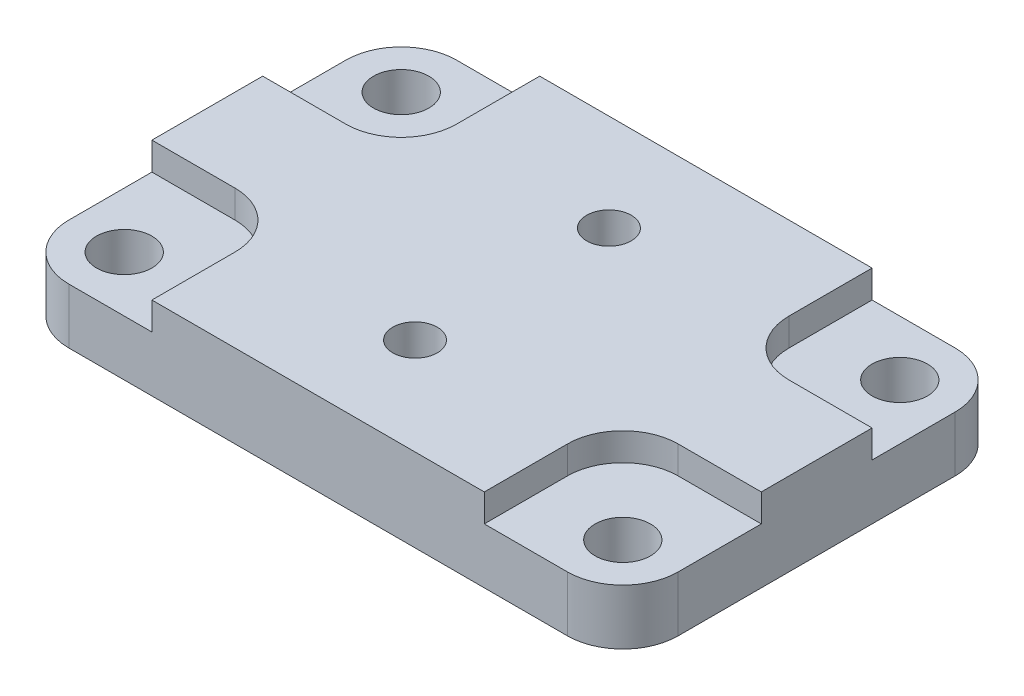
ISO-10303-21;
HEADER;
FILE_DESCRIPTION(('STEP AP214'),'2;1');
FILE_NAME('part.step','',(''),(''),'','','');
FILE_SCHEMA(('AUTOMOTIVE_DESIGN { 1 0 10303 214 1 1 1 1 }'));
ENDSEC;
DATA;
#1=APPLICATION_CONTEXT('core data for automotive mechanical design processes');
#2=APPLICATION_PROTOCOL_DEFINITION('international standard','automotive_design',2000,#1);
#3=PRODUCT_CONTEXT('',#1,'mechanical');
#4=PRODUCT('Part','Part','',(#3));
#5=PRODUCT_RELATED_PRODUCT_CATEGORY('part','',(#4));
#6=PRODUCT_DEFINITION_FORMATION('','',#4);
#7=PRODUCT_DEFINITION_CONTEXT('part definition',#1,'design');
#8=PRODUCT_DEFINITION('design','',#6,#7);
#9=PRODUCT_DEFINITION_SHAPE('','',#8);
#10=(LENGTH_UNIT() NAMED_UNIT(*) SI_UNIT(.MILLI.,.METRE.));
#11=(NAMED_UNIT(*) PLANE_ANGLE_UNIT() SI_UNIT($,.RADIAN.));
#12=(NAMED_UNIT(*) SI_UNIT($,.STERADIAN.) SOLID_ANGLE_UNIT());
#13=UNCERTAINTY_MEASURE_WITH_UNIT(LENGTH_MEASURE(1.E-05),#10,'distance_accuracy_value','');
#14=(GEOMETRIC_REPRESENTATION_CONTEXT(3) GLOBAL_UNCERTAINTY_ASSIGNED_CONTEXT((#13)) GLOBAL_UNIT_ASSIGNED_CONTEXT((#10,
#11,#12)) REPRESENTATION_CONTEXT('',''));
#15=CARTESIAN_POINT('',(0.,0.,0.));
#16=DIRECTION('',(0.,0.,1.));
#17=DIRECTION('',(1.,0.,0.));
#18=AXIS2_PLACEMENT_3D('',#15,#16,#17);
#19=CARTESIAN_POINT('',(0.,9.525,0.));
#20=DIRECTION('',(0.,1.,0.));
#21=DIRECTION('',(0.,0.,1.));
#22=AXIS2_PLACEMENT_3D('',#19,#20,#21);
#23=PLANE('',#22);
#24=DIRECTION('',(0.,0.,1.));
#25=VECTOR('',#24,1.);
#26=CARTESIAN_POINT('',(19.05,9.525,22.225));
#27=LINE('',#26,#25);
#28=CARTESIAN_POINT('',(19.05,9.525,12.7));
#29=VERTEX_POINT('',#28);
#30=CARTESIAN_POINT('',(19.05,9.525,22.225));
#31=VERTEX_POINT('',#30);
#32=EDGE_CURVE('E217',#29,#31,#27,.T.);
#33=ORIENTED_EDGE('',*,*,#32,.F.);
#34=CARTESIAN_POINT('',(25.4,9.525,12.7));
#35=DIRECTION('',(0.,1.,0.));
#36=DIRECTION('',(0.,0.,1.));
#37=AXIS2_PLACEMENT_3D('',#34,#35,#36);
#38=CIRCLE('',#37,6.35);
#39=CARTESIAN_POINT('',(25.4,9.525,6.35));
#40=VERTEX_POINT('',#39);
#41=EDGE_CURVE('E11',#29,#40,#38,.F.);
#42=ORIENTED_EDGE('',*,*,#41,.T.);
#43=DIRECTION('',(-1.,0.,0.));
#44=VECTOR('',#43,1.);
#45=CARTESIAN_POINT('',(19.05,9.525,6.35));
#46=LINE('',#45,#44);
#47=CARTESIAN_POINT('',(34.925,9.525,6.35));
#48=VERTEX_POINT('',#47);
#49=EDGE_CURVE('E212',#48,#40,#46,.T.);
#50=ORIENTED_EDGE('',*,*,#49,.F.);
#51=DIRECTION('',(0.,0.,-1.));
#52=VECTOR('',#51,1.);
#53=CARTESIAN_POINT('',(34.925,9.525,-22.225));
#54=LINE('',#53,#52);
#55=CARTESIAN_POINT('',(34.925,9.525,-6.35));
#56=VERTEX_POINT('',#55);
#57=EDGE_CURVE('E389',#48,#56,#54,.T.);
#58=ORIENTED_EDGE('',*,*,#57,.T.);
#59=DIRECTION('',(-1.,0.,0.));
#60=VECTOR('',#59,1.);
#61=CARTESIAN_POINT('',(19.05,9.525,-6.35));
#62=LINE('',#61,#60);
#63=CARTESIAN_POINT('',(25.4,9.525,-6.35));
#64=VERTEX_POINT('',#63);
#65=EDGE_CURVE('E253',#56,#64,#62,.T.);
#66=ORIENTED_EDGE('',*,*,#65,.T.);
#67=CARTESIAN_POINT('',(25.4,9.525,-12.7));
#68=DIRECTION('',(0.,1.,0.));
#69=DIRECTION('',(0.,0.,1.));
#70=AXIS2_PLACEMENT_3D('',#67,#68,#69);
#71=CIRCLE('',#70,6.35);
#72=CARTESIAN_POINT('',(19.05,9.525,-12.7));
#73=VERTEX_POINT('',#72);
#74=EDGE_CURVE('E499',#64,#73,#71,.F.);
#75=ORIENTED_EDGE('',*,*,#74,.T.);
#76=DIRECTION('',(0.,0.,-1.));
#77=VECTOR('',#76,1.);
#78=CARTESIAN_POINT('',(19.05,9.525,-22.225));
#79=LINE('',#78,#77);
#80=CARTESIAN_POINT('',(19.05,9.525,-22.225));
#81=VERTEX_POINT('',#80);
#82=EDGE_CURVE('E248',#73,#81,#79,.T.);
#83=ORIENTED_EDGE('',*,*,#82,.T.);
#84=DIRECTION('',(-1.,0.,0.));
#85=VECTOR('',#84,1.);
#86=CARTESIAN_POINT('',(-34.925,9.525,-22.225));
#87=LINE('',#86,#85);
#88=CARTESIAN_POINT('',(-19.05,9.525,-22.225));
#89=VERTEX_POINT('',#88);
#90=EDGE_CURVE('E392',#81,#89,#87,.T.);
#91=ORIENTED_EDGE('',*,*,#90,.T.);
#92=DIRECTION('',(0.,0.,-1.));
#93=VECTOR('',#92,1.);
#94=CARTESIAN_POINT('',(-19.05,9.525,-22.225));
#95=LINE('',#94,#93);
#96=CARTESIAN_POINT('',(-19.05,9.525,-12.7));
#97=VERTEX_POINT('',#96);
#98=EDGE_CURVE('E316',#97,#89,#95,.T.);
#99=ORIENTED_EDGE('',*,*,#98,.F.);
#100=CARTESIAN_POINT('',(-25.4,9.525,-12.7));
#101=DIRECTION('',(0.,1.,0.));
#102=DIRECTION('',(0.,0.,1.));
#103=AXIS2_PLACEMENT_3D('',#100,#101,#102);
#104=CIRCLE('',#103,6.35);
#105=CARTESIAN_POINT('',(-25.4,9.525,-6.35));
#106=VERTEX_POINT('',#105);
#107=EDGE_CURVE('E467',#97,#106,#104,.F.);
#108=ORIENTED_EDGE('',*,*,#107,.T.);
#109=DIRECTION('',(1.,0.,0.));
#110=VECTOR('',#109,1.);
#111=CARTESIAN_POINT('',(-19.05,9.525,-6.35));
#112=LINE('',#111,#110);
#113=CARTESIAN_POINT('',(-34.925,9.525,-6.35));
#114=VERTEX_POINT('',#113);
#115=EDGE_CURVE('E321',#114,#106,#112,.T.);
#116=ORIENTED_EDGE('',*,*,#115,.F.);
#117=DIRECTION('',(0.,0.,1.));
#118=VECTOR('',#117,1.);
#119=CARTESIAN_POINT('',(-34.925,9.525,-22.225));
#120=LINE('',#119,#118);
#121=CARTESIAN_POINT('',(-34.925,9.525,6.35));
#122=VERTEX_POINT('',#121);
#123=EDGE_CURVE('E396',#114,#122,#120,.T.);
#124=ORIENTED_EDGE('',*,*,#123,.T.);
#125=DIRECTION('',(1.,0.,0.));
#126=VECTOR('',#125,1.);
#127=CARTESIAN_POINT('',(-19.05,9.525,6.35));
#128=LINE('',#127,#126);
#129=CARTESIAN_POINT('',(-25.4,9.525,6.35));
#130=VERTEX_POINT('',#129);
#131=EDGE_CURVE('E287',#122,#130,#128,.T.);
#132=ORIENTED_EDGE('',*,*,#131,.T.);
#133=CARTESIAN_POINT('',(-25.4,9.525,12.7));
#134=DIRECTION('',(0.,1.,0.));
#135=DIRECTION('',(0.,0.,1.));
#136=AXIS2_PLACEMENT_3D('',#133,#134,#135);
#137=CIRCLE('',#136,6.35);
#138=CARTESIAN_POINT('',(-19.05,9.525,12.7));
#139=VERTEX_POINT('',#138);
#140=EDGE_CURVE('E483',#130,#139,#137,.F.);
#141=ORIENTED_EDGE('',*,*,#140,.T.);
#142=DIRECTION('',(0.,0.,1.));
#143=VECTOR('',#142,1.);
#144=CARTESIAN_POINT('',(-19.05,9.525,22.225));
#145=LINE('',#144,#143);
#146=CARTESIAN_POINT('',(-19.05,9.525,22.225));
#147=VERTEX_POINT('',#146);
#148=EDGE_CURVE('E282',#139,#147,#145,.T.);
#149=ORIENTED_EDGE('',*,*,#148,.T.);
#150=DIRECTION('',(1.,0.,0.));
#151=VECTOR('',#150,1.);
#152=CARTESIAN_POINT('',(-34.925,9.525,22.225));
#153=LINE('',#152,#151);
#154=EDGE_CURVE('E400',#147,#31,#153,.T.);
#155=ORIENTED_EDGE('',*,*,#154,.T.);
#156=EDGE_LOOP('',(#33,#42,#50,#58,#66,#75,#83,#91,#99,#108,#116,#124,#132,#141,#149,#155));
#157=FACE_BOUND('',#156,.T.);
#158=CARTESIAN_POINT('',(0.,9.525,11.1125));
#159=DIRECTION('',(0.,-1.,0.));
#160=DIRECTION('',(0.,0.,-1.));
#161=AXIS2_PLACEMENT_3D('',#158,#159,#160);
#162=CIRCLE('',#161,2.5527);
#163=CARTESIAN_POINT('',(0.,9.525,8.5598));
#164=VERTEX_POINT('',#163);
#165=EDGE_CURVE('E384',#164,#164,#162,.T.);
#166=ORIENTED_EDGE('',*,*,#165,.T.);
#167=EDGE_LOOP('',(#166));
#168=FACE_BOUND('',#167,.T.);
#169=CARTESIAN_POINT('',(0.,9.525,-11.1125));
#170=DIRECTION('',(0.,-1.,0.));
#171=DIRECTION('',(0.,0.,-1.));
#172=AXIS2_PLACEMENT_3D('',#169,#170,#171);
#173=CIRCLE('',#172,2.5527);
#174=CARTESIAN_POINT('',(0.,9.525,-13.6652));
#175=VERTEX_POINT('',#174);
#176=EDGE_CURVE('E372',#175,#175,#173,.T.);
#177=ORIENTED_EDGE('',*,*,#176,.T.);
#178=EDGE_LOOP('',(#177));
#179=FACE_BOUND('',#178,.T.);
#180=ADVANCED_FACE('F39',(#157,#168,#179),#23,.T.);
#181=CARTESIAN_POINT('',(34.925,9.525,-22.225));
#182=DIRECTION('',(-1.,0.,0.));
#183=DIRECTION('',(0.,0.,1.));
#184=AXIS2_PLACEMENT_3D('',#181,#182,#183);
#185=PLANE('',#184);
#186=ORIENTED_EDGE('',*,*,#57,.F.);
#187=DIRECTION('',(0.,1.,0.));
#188=VECTOR('',#187,1.);
#189=CARTESIAN_POINT('',(34.925,6.35,6.35));
#190=LINE('',#189,#188);
#191=CARTESIAN_POINT('',(34.925,6.35,6.35));
#192=VERTEX_POINT('',#191);
#193=EDGE_CURVE('E222',#192,#48,#190,.T.);
#194=ORIENTED_EDGE('',*,*,#193,.F.);
#195=DIRECTION('',(0.,0.,-1.));
#196=VECTOR('',#195,1.);
#197=CARTESIAN_POINT('',(34.925,6.35,22.225));
#198=LINE('',#197,#196);
#199=CARTESIAN_POINT('',(34.925,6.35,15.875));
#200=VERTEX_POINT('',#199);
#201=EDGE_CURVE('E231',#200,#192,#198,.T.);
#202=ORIENTED_EDGE('',*,*,#201,.F.);
#203=DIRECTION('',(0.,-1.,0.));
#204=VECTOR('',#203,1.);
#205=CARTESIAN_POINT('',(34.925,9.525,15.875));
#206=LINE('',#205,#204);
#207=CARTESIAN_POINT('',(34.925,0.,15.875));
#208=VERTEX_POINT('',#207);
#209=EDGE_CURVE('E444',#200,#208,#206,.T.);
#210=ORIENTED_EDGE('',*,*,#209,.T.);
#211=DIRECTION('',(0.,0.,-1.));
#212=VECTOR('',#211,1.);
#213=CARTESIAN_POINT('',(34.925,0.,-22.225));
#214=LINE('',#213,#212);
#215=CARTESIAN_POINT('',(34.925,0.,-15.875));
#216=VERTEX_POINT('',#215);
#217=EDGE_CURVE('E388',#208,#216,#214,.T.);
#218=ORIENTED_EDGE('',*,*,#217,.T.);
#219=DIRECTION('',(0.,-1.,0.));
#220=VECTOR('',#219,1.);
#221=CARTESIAN_POINT('',(34.925,9.525,-15.875));
#222=LINE('',#221,#220);
#223=CARTESIAN_POINT('',(34.925,6.35,-15.875));
#224=VERTEX_POINT('',#223);
#225=EDGE_CURVE('E440',#216,#224,#222,.F.);
#226=ORIENTED_EDGE('',*,*,#225,.T.);
#227=DIRECTION('',(0.,0.,1.));
#228=VECTOR('',#227,1.);
#229=CARTESIAN_POINT('',(34.925,6.35,-22.225));
#230=LINE('',#229,#228);
#231=CARTESIAN_POINT('',(34.925,6.35,-6.35));
#232=VERTEX_POINT('',#231);
#233=EDGE_CURVE('E257',#224,#232,#230,.T.);
#234=ORIENTED_EDGE('',*,*,#233,.T.);
#235=DIRECTION('',(0.,1.,0.));
#236=VECTOR('',#235,1.);
#237=CARTESIAN_POINT('',(34.925,6.35,-6.35));
#238=LINE('',#237,#236);
#239=EDGE_CURVE('E265',#232,#56,#238,.T.);
#240=ORIENTED_EDGE('',*,*,#239,.T.);
#241=EDGE_LOOP('',(#186,#194,#202,#210,#218,#226,#234,#240));
#242=FACE_BOUND('',#241,.T.);
#243=ADVANCED_FACE('F550',(#242),#185,.F.);
#244=CARTESIAN_POINT('',(-34.925,9.525,-22.225));
#245=DIRECTION('',(0.,0.,1.));
#246=DIRECTION('',(1.,0.,0.));
#247=AXIS2_PLACEMENT_3D('',#244,#245,#246);
#248=PLANE('',#247);
#249=DIRECTION('',(0.,1.,0.));
#250=VECTOR('',#249,1.);
#251=CARTESIAN_POINT('',(19.05,6.35,-22.225));
#252=LINE('',#251,#250);
#253=CARTESIAN_POINT('',(19.05,6.35,-22.225));
#254=VERTEX_POINT('',#253);
#255=EDGE_CURVE('E271',#254,#81,#252,.T.);
#256=ORIENTED_EDGE('',*,*,#255,.F.);
#257=DIRECTION('',(1.,0.,0.));
#258=VECTOR('',#257,1.);
#259=CARTESIAN_POINT('',(19.05,6.35,-22.225));
#260=LINE('',#259,#258);
#261=CARTESIAN_POINT('',(28.575,6.35,-22.225));
#262=VERTEX_POINT('',#261);
#263=EDGE_CURVE('E261',#254,#262,#260,.T.);
#264=ORIENTED_EDGE('',*,*,#263,.T.);
#265=DIRECTION('',(0.,-1.,0.));
#266=VECTOR('',#265,1.);
#267=CARTESIAN_POINT('',(28.575,9.525,-22.225));
#268=LINE('',#267,#266);
#269=CARTESIAN_POINT('',(28.575,0.,-22.225));
#270=VERTEX_POINT('',#269);
#271=EDGE_CURVE('E451',#262,#270,#268,.T.);
#272=ORIENTED_EDGE('',*,*,#271,.T.);
#273=DIRECTION('',(-1.,0.,0.));
#274=VECTOR('',#273,1.);
#275=CARTESIAN_POINT('',(-34.925,0.,-22.225));
#276=LINE('',#275,#274);
#277=CARTESIAN_POINT('',(-28.575,0.,-22.225));
#278=VERTEX_POINT('',#277);
#279=EDGE_CURVE('E406',#270,#278,#276,.T.);
#280=ORIENTED_EDGE('',*,*,#279,.T.);
#281=DIRECTION('',(0.,-1.,0.));
#282=VECTOR('',#281,1.);
#283=CARTESIAN_POINT('',(-28.575,9.525,-22.225));
#284=LINE('',#283,#282);
#285=CARTESIAN_POINT('',(-28.575,6.35,-22.225));
#286=VERTEX_POINT('',#285);
#287=EDGE_CURVE('E447',#278,#286,#284,.F.);
#288=ORIENTED_EDGE('',*,*,#287,.T.);
#289=DIRECTION('',(-1.,0.,0.));
#290=VECTOR('',#289,1.);
#291=CARTESIAN_POINT('',(-19.05,6.35,-22.225));
#292=LINE('',#291,#290);
#293=CARTESIAN_POINT('',(-19.05,6.35,-22.225));
#294=VERTEX_POINT('',#293);
#295=EDGE_CURVE('E320',#294,#286,#292,.T.);
#296=ORIENTED_EDGE('',*,*,#295,.F.);
#297=DIRECTION('',(0.,1.,0.));
#298=VECTOR('',#297,1.);
#299=CARTESIAN_POINT('',(-19.05,6.35,-22.225));
#300=LINE('',#299,#298);
#301=EDGE_CURVE('E331',#294,#89,#300,.T.);
#302=ORIENTED_EDGE('',*,*,#301,.T.);
#303=ORIENTED_EDGE('',*,*,#90,.F.);
#304=EDGE_LOOP('',(#256,#264,#272,#280,#288,#296,#302,#303));
#305=FACE_BOUND('',#304,.T.);
#306=ADVANCED_FACE('F570',(#305),#248,.F.);
#307=CARTESIAN_POINT('',(-34.925,9.525,-22.225));
#308=DIRECTION('',(1.,0.,0.));
#309=DIRECTION('',(0.,0.,-1.));
#310=AXIS2_PLACEMENT_3D('',#307,#308,#309);
#311=PLANE('',#310);
#312=DIRECTION('',(0.,1.,0.));
#313=VECTOR('',#312,1.);
#314=CARTESIAN_POINT('',(-34.925,6.35,6.35));
#315=LINE('',#314,#313);
#316=CARTESIAN_POINT('',(-34.925,6.35,6.35));
#317=VERTEX_POINT('',#316);
#318=EDGE_CURVE('E299',#317,#122,#315,.T.);
#319=ORIENTED_EDGE('',*,*,#318,.T.);
#320=ORIENTED_EDGE('',*,*,#123,.F.);
#321=DIRECTION('',(0.,1.,0.));
#322=VECTOR('',#321,1.);
#323=CARTESIAN_POINT('',(-34.925,6.35,-6.35));
#324=LINE('',#323,#322);
#325=CARTESIAN_POINT('',(-34.925,6.35,-6.35));
#326=VERTEX_POINT('',#325);
#327=EDGE_CURVE('E338',#326,#114,#324,.T.);
#328=ORIENTED_EDGE('',*,*,#327,.F.);
#329=DIRECTION('',(0.,0.,1.));
#330=VECTOR('',#329,1.);
#331=CARTESIAN_POINT('',(-34.925,6.35,-22.225));
#332=LINE('',#331,#330);
#333=CARTESIAN_POINT('',(-34.925,6.35,-15.875));
#334=VERTEX_POINT('',#333);
#335=EDGE_CURVE('E324',#334,#326,#332,.T.);
#336=ORIENTED_EDGE('',*,*,#335,.F.);
#337=DIRECTION('',(0.,-1.,0.));
#338=VECTOR('',#337,1.);
#339=CARTESIAN_POINT('',(-34.925,9.525,-15.875));
#340=LINE('',#339,#338);
#341=CARTESIAN_POINT('',(-34.925,0.,-15.875));
#342=VERTEX_POINT('',#341);
#343=EDGE_CURVE('E433',#334,#342,#340,.T.);
#344=ORIENTED_EDGE('',*,*,#343,.T.);
#345=DIRECTION('',(0.,0.,1.));
#346=VECTOR('',#345,1.);
#347=CARTESIAN_POINT('',(-34.925,0.,-22.225));
#348=LINE('',#347,#346);
#349=CARTESIAN_POINT('',(-34.925,0.,15.875));
#350=VERTEX_POINT('',#349);
#351=EDGE_CURVE('E410',#342,#350,#348,.T.);
#352=ORIENTED_EDGE('',*,*,#351,.T.);
#353=DIRECTION('',(0.,-1.,0.));
#354=VECTOR('',#353,1.);
#355=CARTESIAN_POINT('',(-34.925,9.525,15.875));
#356=LINE('',#355,#354);
#357=CARTESIAN_POINT('',(-34.925,6.35,15.875));
#358=VERTEX_POINT('',#357);
#359=EDGE_CURVE('E436',#350,#358,#356,.F.);
#360=ORIENTED_EDGE('',*,*,#359,.T.);
#361=DIRECTION('',(0.,0.,-1.));
#362=VECTOR('',#361,1.);
#363=CARTESIAN_POINT('',(-34.925,6.35,22.225));
#364=LINE('',#363,#362);
#365=EDGE_CURVE('E291',#358,#317,#364,.T.);
#366=ORIENTED_EDGE('',*,*,#365,.T.);
#367=EDGE_LOOP('',(#319,#320,#328,#336,#344,#352,#360,#366));
#368=FACE_BOUND('',#367,.T.);
#369=ADVANCED_FACE('F531',(#368),#311,.F.);
#370=CARTESIAN_POINT('',(-34.925,9.525,22.225));
#371=DIRECTION('',(0.,0.,-1.));
#372=DIRECTION('',(-1.,0.,0.));
#373=AXIS2_PLACEMENT_3D('',#370,#371,#372);
#374=PLANE('',#373);
#375=DIRECTION('',(1.,0.,0.));
#376=VECTOR('',#375,1.);
#377=CARTESIAN_POINT('',(19.05,6.35,22.225));
#378=LINE('',#377,#376);
#379=CARTESIAN_POINT('',(19.05,6.35,22.225));
#380=VERTEX_POINT('',#379);
#381=CARTESIAN_POINT('',(28.575,6.35,22.225));
#382=VERTEX_POINT('',#381);
#383=EDGE_CURVE('E205',#380,#382,#378,.T.);
#384=ORIENTED_EDGE('',*,*,#383,.F.);
#385=DIRECTION('',(0.,1.,0.));
#386=VECTOR('',#385,1.);
#387=CARTESIAN_POINT('',(19.05,6.35,22.225));
#388=LINE('',#387,#386);
#389=EDGE_CURVE('E215',#380,#31,#388,.T.);
#390=ORIENTED_EDGE('',*,*,#389,.T.);
#391=ORIENTED_EDGE('',*,*,#154,.F.);
#392=DIRECTION('',(0.,1.,0.));
#393=VECTOR('',#392,1.);
#394=CARTESIAN_POINT('',(-19.05,6.35,22.225));
#395=LINE('',#394,#393);
#396=CARTESIAN_POINT('',(-19.05,6.35,22.225));
#397=VERTEX_POINT('',#396);
#398=EDGE_CURVE('E305',#397,#147,#395,.T.);
#399=ORIENTED_EDGE('',*,*,#398,.F.);
#400=DIRECTION('',(-1.,0.,0.));
#401=VECTOR('',#400,1.);
#402=CARTESIAN_POINT('',(-19.05,6.35,22.225));
#403=LINE('',#402,#401);
#404=CARTESIAN_POINT('',(-28.575,6.35,22.225));
#405=VERTEX_POINT('',#404);
#406=EDGE_CURVE('E295',#397,#405,#403,.T.);
#407=ORIENTED_EDGE('',*,*,#406,.T.);
#408=DIRECTION('',(0.,-1.,0.));
#409=VECTOR('',#408,1.);
#410=CARTESIAN_POINT('',(-28.575,9.525,22.225));
#411=LINE('',#410,#409);
#412=CARTESIAN_POINT('',(-28.575,0.,22.225));
#413=VERTEX_POINT('',#412);
#414=EDGE_CURVE('E418',#405,#413,#411,.T.);
#415=ORIENTED_EDGE('',*,*,#414,.T.);
#416=DIRECTION('',(1.,0.,0.));
#417=VECTOR('',#416,1.);
#418=CARTESIAN_POINT('',(-34.925,0.,22.225));
#419=LINE('',#418,#417);
#420=CARTESIAN_POINT('',(28.575,0.,22.225));
#421=VERTEX_POINT('',#420);
#422=EDGE_CURVE('E393',#413,#421,#419,.T.);
#423=ORIENTED_EDGE('',*,*,#422,.T.);
#424=DIRECTION('',(0.,-1.,0.));
#425=VECTOR('',#424,1.);
#426=CARTESIAN_POINT('',(28.575,9.525,22.225));
#427=LINE('',#426,#425);
#428=EDGE_CURVE('E229',#421,#382,#427,.F.);
#429=ORIENTED_EDGE('',*,*,#428,.T.);
#430=EDGE_LOOP('',(#384,#390,#391,#399,#407,#415,#423,#429));
#431=FACE_BOUND('',#430,.T.);
#432=ADVANCED_FACE('F226',(#431),#374,.F.);
#433=CARTESIAN_POINT('',(0.,0.,0.));
#434=DIRECTION('',(0.,1.,0.));
#435=DIRECTION('',(0.,0.,1.));
#436=AXIS2_PLACEMENT_3D('',#433,#434,#435);
#437=PLANE('',#436);
#438=CARTESIAN_POINT('',(28.575,0.,-15.875));
#439=DIRECTION('',(0.,-1.,0.));
#440=DIRECTION('',(0.,0.,-1.));
#441=AXIS2_PLACEMENT_3D('',#438,#439,#440);
#442=CIRCLE('',#441,3.175);
#443=CARTESIAN_POINT('',(28.575,0.,-19.05));
#444=VERTEX_POINT('',#443);
#445=EDGE_CURVE('E356',#444,#444,#442,.T.);
#446=ORIENTED_EDGE('',*,*,#445,.F.);
#447=EDGE_LOOP('',(#446));
#448=FACE_BOUND('',#447,.T.);
#449=CARTESIAN_POINT('',(28.575,0.,15.875));
#450=DIRECTION('',(0.,-1.,0.));
#451=DIRECTION('',(0.,0.,-1.));
#452=AXIS2_PLACEMENT_3D('',#449,#450,#451);
#453=CIRCLE('',#452,3.175);
#454=CARTESIAN_POINT('',(28.575,0.,12.7));
#455=VERTEX_POINT('',#454);
#456=EDGE_CURVE('E360',#455,#455,#453,.T.);
#457=ORIENTED_EDGE('',*,*,#456,.F.);
#458=EDGE_LOOP('',(#457));
#459=FACE_BOUND('',#458,.T.);
#460=CARTESIAN_POINT('',(0.,0.,-11.1125));
#461=DIRECTION('',(0.,-1.,0.));
#462=DIRECTION('',(0.,0.,-1.));
#463=AXIS2_PLACEMENT_3D('',#460,#461,#462);
#464=CIRCLE('',#463,4.8895);
#465=CARTESIAN_POINT('',(0.,0.,-16.002));
#466=VERTEX_POINT('',#465);
#467=EDGE_CURVE('E364',#466,#466,#464,.T.);
#468=ORIENTED_EDGE('',*,*,#467,.F.);
#469=EDGE_LOOP('',(#468));
#470=FACE_BOUND('',#469,.T.);
#471=CARTESIAN_POINT('',(0.,0.,11.1125));
#472=DIRECTION('',(0.,-1.,0.));
#473=DIRECTION('',(0.,0.,-1.));
#474=AXIS2_PLACEMENT_3D('',#471,#472,#473);
#475=CIRCLE('',#474,4.8895);
#476=CARTESIAN_POINT('',(0.,0.,6.223));
#477=VERTEX_POINT('',#476);
#478=EDGE_CURVE('E376',#477,#477,#475,.T.);
#479=ORIENTED_EDGE('',*,*,#478,.F.);
#480=EDGE_LOOP('',(#479));
#481=FACE_BOUND('',#480,.T.);
#482=ORIENTED_EDGE('',*,*,#422,.F.);
#483=CARTESIAN_POINT('',(-28.575,0.,15.875));
#484=DIRECTION('',(0.,1.,0.));
#485=DIRECTION('',(0.,0.,1.));
#486=AXIS2_PLACEMENT_3D('',#483,#484,#485);
#487=CIRCLE('',#486,6.35);
#488=EDGE_CURVE('E430',#413,#350,#487,.F.);
#489=ORIENTED_EDGE('',*,*,#488,.T.);
#490=ORIENTED_EDGE('',*,*,#351,.F.);
#491=CARTESIAN_POINT('',(-28.575,0.,-15.875));
#492=DIRECTION('',(0.,1.,0.));
#493=DIRECTION('',(0.,0.,1.));
#494=AXIS2_PLACEMENT_3D('',#491,#492,#493);
#495=CIRCLE('',#494,6.35);
#496=EDGE_CURVE('E421',#342,#278,#495,.F.);
#497=ORIENTED_EDGE('',*,*,#496,.T.);
#498=ORIENTED_EDGE('',*,*,#279,.F.);
#499=CARTESIAN_POINT('',(28.575,0.,-15.875));
#500=DIRECTION('',(0.,1.,0.));
#501=DIRECTION('',(0.,0.,1.));
#502=AXIS2_PLACEMENT_3D('',#499,#500,#501);
#503=CIRCLE('',#502,6.35);
#504=EDGE_CURVE('E424',#270,#216,#503,.F.);
#505=ORIENTED_EDGE('',*,*,#504,.T.);
#506=ORIENTED_EDGE('',*,*,#217,.F.);
#507=CARTESIAN_POINT('',(28.575,0.,15.875));
#508=DIRECTION('',(0.,1.,0.));
#509=DIRECTION('',(0.,0.,1.));
#510=AXIS2_PLACEMENT_3D('',#507,#508,#509);
#511=CIRCLE('',#510,6.35);
#512=EDGE_CURVE('E427',#208,#421,#511,.F.);
#513=ORIENTED_EDGE('',*,*,#512,.T.);
#514=EDGE_LOOP('',(#482,#489,#490,#497,#498,#505,#506,#513));
#515=FACE_BOUND('',#514,.T.);
#516=CARTESIAN_POINT('',(-28.575,0.,15.875));
#517=DIRECTION('',(0.,-1.,0.));
#518=DIRECTION('',(0.,0.,-1.));
#519=AXIS2_PLACEMENT_3D('',#516,#517,#518);
#520=CIRCLE('',#519,3.175);
#521=CARTESIAN_POINT('',(-28.575,0.,12.7));
#522=VERTEX_POINT('',#521);
#523=EDGE_CURVE('E352',#522,#522,#520,.T.);
#524=ORIENTED_EDGE('',*,*,#523,.F.);
#525=EDGE_LOOP('',(#524));
#526=FACE_BOUND('',#525,.T.);
#527=CARTESIAN_POINT('',(-28.575,0.,-15.875));
#528=DIRECTION('',(0.,-1.,0.));
#529=DIRECTION('',(0.,0.,-1.));
#530=AXIS2_PLACEMENT_3D('',#527,#528,#529);
#531=CIRCLE('',#530,3.175);
#532=CARTESIAN_POINT('',(-28.575,0.,-19.05));
#533=VERTEX_POINT('',#532);
#534=EDGE_CURVE('E348',#533,#533,#531,.T.);
#535=ORIENTED_EDGE('',*,*,#534,.F.);
#536=EDGE_LOOP('',(#535));
#537=FACE_BOUND('',#536,.T.);
#538=ADVANCED_FACE('F538',(#448,#459,#470,#481,#515,#526,#537),#437,.F.);
#539=CARTESIAN_POINT('',(0.,0.,11.1125));
#540=DIRECTION('',(0.,-1.,0.));
#541=DIRECTION('',(0.,0.,-1.));
#542=AXIS2_PLACEMENT_3D('',#539,#540,#541);
#543=CYLINDRICAL_SURFACE('',#542,2.5527);
#544=ORIENTED_EDGE('',*,*,#165,.F.);
#545=EDGE_LOOP('',(#544));
#546=FACE_BOUND('',#545,.T.);
#547=CARTESIAN_POINT('',(0.,2.68818089399406,11.1125));
#548=DIRECTION('',(0.,-1.,0.));
#549=DIRECTION('',(0.,0.,-1.));
#550=AXIS2_PLACEMENT_3D('',#547,#548,#549);
#551=CIRCLE('',#550,2.5527);
#552=CARTESIAN_POINT('',(0.,2.68818089399406,8.5598));
#553=VERTEX_POINT('',#552);
#554=EDGE_CURVE('E380',#553,#553,#551,.T.);
#555=ORIENTED_EDGE('',*,*,#554,.T.);
#556=EDGE_LOOP('',(#555));
#557=FACE_BOUND('',#556,.T.);
#558=ADVANCED_FACE('F619',(#546,#557),#543,.F.);
#559=CARTESIAN_POINT('',(0.,0.,11.1125));
#560=DIRECTION('',(0.,-1.,0.));
#561=DIRECTION('',(0.,0.,-1.));
#562=AXIS2_PLACEMENT_3D('',#559,#560,#561);
#563=CONICAL_SURFACE('',#562,4.8895,0.715584993317675);
#564=ORIENTED_EDGE('',*,*,#554,.F.);
#565=EDGE_LOOP('',(#564));
#566=FACE_BOUND('',#565,.T.);
#567=ORIENTED_EDGE('',*,*,#478,.T.);
#568=EDGE_LOOP('',(#567));
#569=FACE_BOUND('',#568,.T.);
#570=ADVANCED_FACE('F676',(#566,#569),#563,.F.);
#571=CARTESIAN_POINT('',(0.,0.,-11.1125));
#572=DIRECTION('',(0.,-1.,0.));
#573=DIRECTION('',(0.,0.,-1.));
#574=AXIS2_PLACEMENT_3D('',#571,#572,#573);
#575=CYLINDRICAL_SURFACE('',#574,2.5527);
#576=ORIENTED_EDGE('',*,*,#176,.F.);
#577=EDGE_LOOP('',(#576));
#578=FACE_BOUND('',#577,.T.);
#579=CARTESIAN_POINT('',(0.,2.68818089399406,-11.1125));
#580=DIRECTION('',(0.,-1.,0.));
#581=DIRECTION('',(0.,0.,-1.));
#582=AXIS2_PLACEMENT_3D('',#579,#580,#581);
#583=CIRCLE('',#582,2.5527);
#584=CARTESIAN_POINT('',(0.,2.68818089399406,-13.6652));
#585=VERTEX_POINT('',#584);
#586=EDGE_CURVE('E368',#585,#585,#583,.T.);
#587=ORIENTED_EDGE('',*,*,#586,.T.);
#588=EDGE_LOOP('',(#587));
#589=FACE_BOUND('',#588,.T.);
#590=ADVANCED_FACE('F673',(#578,#589),#575,.F.);
#591=CARTESIAN_POINT('',(0.,0.,-11.1125));
#592=DIRECTION('',(0.,-1.,0.));
#593=DIRECTION('',(0.,0.,-1.));
#594=AXIS2_PLACEMENT_3D('',#591,#592,#593);
#595=CONICAL_SURFACE('',#594,4.8895,0.715584993317675);
#596=ORIENTED_EDGE('',*,*,#586,.F.);
#597=EDGE_LOOP('',(#596));
#598=FACE_BOUND('',#597,.T.);
#599=ORIENTED_EDGE('',*,*,#467,.T.);
#600=EDGE_LOOP('',(#599));
#601=FACE_BOUND('',#600,.T.);
#602=ADVANCED_FACE('F632',(#598,#601),#595,.F.);
#603=CARTESIAN_POINT('',(-28.575,9.525,15.875));
#604=DIRECTION('',(0.,-1.,0.));
#605=DIRECTION('',(0.,0.,-1.));
#606=AXIS2_PLACEMENT_3D('',#603,#604,#605);
#607=CYLINDRICAL_SURFACE('',#606,6.35);
#608=CARTESIAN_POINT('',(-28.575,6.35,15.875));
#609=DIRECTION('',(0.,-1.,0.));
#610=DIRECTION('',(0.,0.,-1.));
#611=AXIS2_PLACEMENT_3D('',#608,#609,#610);
#612=CIRCLE('',#611,6.35);
#613=EDGE_CURVE('E313',#358,#405,#612,.F.);
#614=ORIENTED_EDGE('',*,*,#613,.F.);
#615=ORIENTED_EDGE('',*,*,#359,.F.);
#616=ORIENTED_EDGE('',*,*,#488,.F.);
#617=ORIENTED_EDGE('',*,*,#414,.F.);
#618=EDGE_LOOP('',(#614,#615,#616,#617));
#619=FACE_BOUND('',#618,.T.);
#620=ADVANCED_FACE('F528',(#619),#607,.T.);
#621=CARTESIAN_POINT('',(28.575,9.525,15.875));
#622=DIRECTION('',(0.,-1.,0.));
#623=DIRECTION('',(0.,0.,-1.));
#624=AXIS2_PLACEMENT_3D('',#621,#622,#623);
#625=CYLINDRICAL_SURFACE('',#624,6.35);
#626=CARTESIAN_POINT('',(28.575,6.35,15.875));
#627=DIRECTION('',(0.,-1.,0.));
#628=DIRECTION('',(0.,0.,-1.));
#629=AXIS2_PLACEMENT_3D('',#626,#627,#628);
#630=CIRCLE('',#629,6.35);
#631=EDGE_CURVE('E245',#382,#200,#630,.F.);
#632=ORIENTED_EDGE('',*,*,#631,.F.);
#633=ORIENTED_EDGE('',*,*,#428,.F.);
#634=ORIENTED_EDGE('',*,*,#512,.F.);
#635=ORIENTED_EDGE('',*,*,#209,.F.);
#636=EDGE_LOOP('',(#632,#633,#634,#635));
#637=FACE_BOUND('',#636,.T.);
#638=ADVANCED_FACE('F544',(#637),#625,.T.);
#639=CARTESIAN_POINT('',(28.575,9.525,-15.875));
#640=DIRECTION('',(0.,-1.,0.));
#641=DIRECTION('',(0.,0.,-1.));
#642=AXIS2_PLACEMENT_3D('',#639,#640,#641);
#643=CYLINDRICAL_SURFACE('',#642,6.35);
#644=CARTESIAN_POINT('',(28.575,6.35,-15.875));
#645=DIRECTION('',(0.,-1.,0.));
#646=DIRECTION('',(0.,0.,-1.));
#647=AXIS2_PLACEMENT_3D('',#644,#645,#646);
#648=CIRCLE('',#647,6.35);
#649=EDGE_CURVE('E279',#224,#262,#648,.F.);
#650=ORIENTED_EDGE('',*,*,#649,.F.);
#651=ORIENTED_EDGE('',*,*,#225,.F.);
#652=ORIENTED_EDGE('',*,*,#504,.F.);
#653=ORIENTED_EDGE('',*,*,#271,.F.);
#654=EDGE_LOOP('',(#650,#651,#652,#653));
#655=FACE_BOUND('',#654,.T.);
#656=ADVANCED_FACE('F566',(#655),#643,.T.);
#657=CARTESIAN_POINT('',(-28.575,9.525,-15.875));
#658=DIRECTION('',(0.,-1.,0.));
#659=DIRECTION('',(0.,0.,-1.));
#660=AXIS2_PLACEMENT_3D('',#657,#658,#659);
#661=CYLINDRICAL_SURFACE('',#660,6.35);
#662=CARTESIAN_POINT('',(-28.575,6.35,-15.875));
#663=DIRECTION('',(0.,-1.,0.));
#664=DIRECTION('',(0.,0.,-1.));
#665=AXIS2_PLACEMENT_3D('',#662,#663,#664);
#666=CIRCLE('',#665,6.35);
#667=EDGE_CURVE('E345',#286,#334,#666,.F.);
#668=ORIENTED_EDGE('',*,*,#667,.F.);
#669=ORIENTED_EDGE('',*,*,#287,.F.);
#670=ORIENTED_EDGE('',*,*,#496,.F.);
#671=ORIENTED_EDGE('',*,*,#343,.F.);
#672=EDGE_LOOP('',(#668,#669,#670,#671));
#673=FACE_BOUND('',#672,.T.);
#674=ADVANCED_FACE('F637',(#673),#661,.T.);
#675=CARTESIAN_POINT('',(28.575,0.,15.875));
#676=DIRECTION('',(0.,-1.,0.));
#677=DIRECTION('',(0.,0.,-1.));
#678=AXIS2_PLACEMENT_3D('',#675,#676,#677);
#679=CYLINDRICAL_SURFACE('',#678,3.175);
#680=CARTESIAN_POINT('',(28.575,6.35,15.875));
#681=DIRECTION('',(0.,-1.,0.));
#682=DIRECTION('',(0.,0.,-1.));
#683=AXIS2_PLACEMENT_3D('',#680,#681,#682);
#684=CIRCLE('',#683,3.175);
#685=CARTESIAN_POINT('',(28.575,6.35,12.7));
#686=VERTEX_POINT('',#685);
#687=EDGE_CURVE('E243',#686,#686,#684,.F.);
#688=ORIENTED_EDGE('',*,*,#687,.T.);
#689=EDGE_LOOP('',(#688));
#690=FACE_BOUND('',#689,.T.);
#691=ORIENTED_EDGE('',*,*,#456,.T.);
#692=EDGE_LOOP('',(#691));
#693=FACE_BOUND('',#692,.T.);
#694=ADVANCED_FACE('F639',(#690,#693),#679,.F.);
#695=CARTESIAN_POINT('',(28.575,0.,-15.875));
#696=DIRECTION('',(0.,-1.,0.));
#697=DIRECTION('',(0.,0.,-1.));
#698=AXIS2_PLACEMENT_3D('',#695,#696,#697);
#699=CYLINDRICAL_SURFACE('',#698,3.175);
#700=CARTESIAN_POINT('',(28.575,6.35,-15.875));
#701=DIRECTION('',(0.,-1.,0.));
#702=DIRECTION('',(0.,0.,-1.));
#703=AXIS2_PLACEMENT_3D('',#700,#701,#702);
#704=CIRCLE('',#703,3.175);
#705=CARTESIAN_POINT('',(28.575,6.35,-19.05));
#706=VERTEX_POINT('',#705);
#707=EDGE_CURVE('E275',#706,#706,#704,.F.);
#708=ORIENTED_EDGE('',*,*,#707,.T.);
#709=EDGE_LOOP('',(#708));
#710=FACE_BOUND('',#709,.T.);
#711=ORIENTED_EDGE('',*,*,#445,.T.);
#712=EDGE_LOOP('',(#711));
#713=FACE_BOUND('',#712,.T.);
#714=ADVANCED_FACE('F663',(#710,#713),#699,.F.);
#715=CARTESIAN_POINT('',(-28.575,0.,15.875));
#716=DIRECTION('',(0.,-1.,0.));
#717=DIRECTION('',(0.,0.,-1.));
#718=AXIS2_PLACEMENT_3D('',#715,#716,#717);
#719=CYLINDRICAL_SURFACE('',#718,3.175);
#720=CARTESIAN_POINT('',(-28.575,6.35,15.875));
#721=DIRECTION('',(0.,-1.,0.));
#722=DIRECTION('',(0.,0.,-1.));
#723=AXIS2_PLACEMENT_3D('',#720,#721,#722);
#724=CIRCLE('',#723,3.175);
#725=CARTESIAN_POINT('',(-28.575,6.35,12.7));
#726=VERTEX_POINT('',#725);
#727=EDGE_CURVE('E309',#726,#726,#724,.F.);
#728=ORIENTED_EDGE('',*,*,#727,.T.);
#729=EDGE_LOOP('',(#728));
#730=FACE_BOUND('',#729,.T.);
#731=ORIENTED_EDGE('',*,*,#523,.T.);
#732=EDGE_LOOP('',(#731));
#733=FACE_BOUND('',#732,.T.);
#734=ADVANCED_FACE('F659',(#730,#733),#719,.F.);
#735=CARTESIAN_POINT('',(-28.575,0.,-15.875));
#736=DIRECTION('',(0.,-1.,0.));
#737=DIRECTION('',(0.,0.,-1.));
#738=AXIS2_PLACEMENT_3D('',#735,#736,#737);
#739=CYLINDRICAL_SURFACE('',#738,3.175);
#740=CARTESIAN_POINT('',(-28.575,6.35,-15.875));
#741=DIRECTION('',(0.,-1.,0.));
#742=DIRECTION('',(0.,0.,-1.));
#743=AXIS2_PLACEMENT_3D('',#740,#741,#742);
#744=CIRCLE('',#743,3.175);
#745=CARTESIAN_POINT('',(-28.575,6.35,-19.05));
#746=VERTEX_POINT('',#745);
#747=EDGE_CURVE('E341',#746,#746,#744,.F.);
#748=ORIENTED_EDGE('',*,*,#747,.T.);
#749=EDGE_LOOP('',(#748));
#750=FACE_BOUND('',#749,.T.);
#751=ORIENTED_EDGE('',*,*,#534,.T.);
#752=EDGE_LOOP('',(#751));
#753=FACE_BOUND('',#752,.T.);
#754=ADVANCED_FACE('F656',(#750,#753),#739,.F.);
#755=CARTESIAN_POINT('',(0.,6.35,0.));
#756=DIRECTION('',(0.,-1.,0.));
#757=DIRECTION('',(0.,0.,-1.));
#758=AXIS2_PLACEMENT_3D('',#755,#756,#757);
#759=PLANE('',#758);
#760=DIRECTION('',(1.,0.,0.));
#761=VECTOR('',#760,1.);
#762=CARTESIAN_POINT('',(-19.05,6.35,-6.35));
#763=LINE('',#762,#761);
#764=CARTESIAN_POINT('',(-25.4,6.35,-6.35));
#765=VERTEX_POINT('',#764);
#766=EDGE_CURVE('E327',#326,#765,#763,.T.);
#767=ORIENTED_EDGE('',*,*,#766,.T.);
#768=CARTESIAN_POINT('',(-25.4,6.35,-12.7));
#769=DIRECTION('',(0.,-1.,0.));
#770=DIRECTION('',(0.,0.,-1.));
#771=AXIS2_PLACEMENT_3D('',#768,#769,#770);
#772=CIRCLE('',#771,6.35);
#773=CARTESIAN_POINT('',(-19.05,6.35,-12.7));
#774=VERTEX_POINT('',#773);
#775=EDGE_CURVE('E464',#765,#774,#772,.F.);
#776=ORIENTED_EDGE('',*,*,#775,.T.);
#777=DIRECTION('',(0.,0.,-1.));
#778=VECTOR('',#777,1.);
#779=CARTESIAN_POINT('',(-19.05,6.35,-22.225));
#780=LINE('',#779,#778);
#781=EDGE_CURVE('E317',#774,#294,#780,.T.);
#782=ORIENTED_EDGE('',*,*,#781,.T.);
#783=ORIENTED_EDGE('',*,*,#295,.T.);
#784=ORIENTED_EDGE('',*,*,#667,.T.);
#785=ORIENTED_EDGE('',*,*,#335,.T.);
#786=EDGE_LOOP('',(#767,#776,#782,#783,#784,#785));
#787=FACE_BOUND('',#786,.T.);
#788=ORIENTED_EDGE('',*,*,#747,.F.);
#789=EDGE_LOOP('',(#788));
#790=FACE_BOUND('',#789,.T.);
#791=ADVANCED_FACE('F651',(#787,#790),#759,.F.);
#792=CARTESIAN_POINT('',(-19.05,6.35,-22.225));
#793=DIRECTION('',(1.,0.,0.));
#794=DIRECTION('',(0.,0.,-1.));
#795=AXIS2_PLACEMENT_3D('',#792,#793,#794);
#796=PLANE('',#795);
#797=ORIENTED_EDGE('',*,*,#781,.F.);
#798=DIRECTION('',(0.,1.,0.));
#799=VECTOR('',#798,1.);
#800=CARTESIAN_POINT('',(-19.05,9.525,-12.7));
#801=LINE('',#800,#799);
#802=EDGE_CURVE('E454',#774,#97,#801,.T.);
#803=ORIENTED_EDGE('',*,*,#802,.T.);
#804=ORIENTED_EDGE('',*,*,#98,.T.);
#805=ORIENTED_EDGE('',*,*,#301,.F.);
#806=EDGE_LOOP('',(#797,#803,#804,#805));
#807=FACE_BOUND('',#806,.T.);
#808=ADVANCED_FACE('F585',(#807),#796,.F.);
#809=CARTESIAN_POINT('',(-19.05,6.35,-6.35));
#810=DIRECTION('',(0.,0.,1.));
#811=DIRECTION('',(1.,0.,0.));
#812=AXIS2_PLACEMENT_3D('',#809,#810,#811);
#813=PLANE('',#812);
#814=ORIENTED_EDGE('',*,*,#115,.T.);
#815=DIRECTION('',(0.,1.,0.));
#816=VECTOR('',#815,1.);
#817=CARTESIAN_POINT('',(-25.4,6.35,-6.35));
#818=LINE('',#817,#816);
#819=EDGE_CURVE('E461',#106,#765,#818,.F.);
#820=ORIENTED_EDGE('',*,*,#819,.T.);
#821=ORIENTED_EDGE('',*,*,#766,.F.);
#822=ORIENTED_EDGE('',*,*,#327,.T.);
#823=EDGE_LOOP('',(#814,#820,#821,#822));
#824=FACE_BOUND('',#823,.T.);
#825=ADVANCED_FACE('F594',(#824),#813,.F.);
#826=CARTESIAN_POINT('',(-25.4,6.35,-12.7));
#827=DIRECTION('',(0.,-1.,0.));
#828=DIRECTION('',(0.,0.,-1.));
#829=AXIS2_PLACEMENT_3D('',#826,#827,#828);
#830=CYLINDRICAL_SURFACE('',#829,6.35);
#831=ORIENTED_EDGE('',*,*,#775,.F.);
#832=ORIENTED_EDGE('',*,*,#819,.F.);
#833=ORIENTED_EDGE('',*,*,#107,.F.);
#834=ORIENTED_EDGE('',*,*,#802,.F.);
#835=EDGE_LOOP('',(#831,#832,#833,#834));
#836=FACE_BOUND('',#835,.T.);
#837=ADVANCED_FACE('F589',(#836),#830,.F.);
#838=CARTESIAN_POINT('',(0.,6.35,0.));
#839=DIRECTION('',(0.,-1.,0.));
#840=DIRECTION('',(0.,0.,1.));
#841=AXIS2_PLACEMENT_3D('',#838,#839,#840);
#842=PLANE('',#841);
#843=DIRECTION('',(0.,0.,1.));
#844=VECTOR('',#843,1.);
#845=CARTESIAN_POINT('',(-19.05,6.35,22.225));
#846=LINE('',#845,#844);
#847=CARTESIAN_POINT('',(-19.05,6.35,12.7));
#848=VERTEX_POINT('',#847);
#849=EDGE_CURVE('E283',#848,#397,#846,.T.);
#850=ORIENTED_EDGE('',*,*,#849,.F.);
#851=CARTESIAN_POINT('',(-25.4,6.35,12.7));
#852=DIRECTION('',(0.,-1.,0.));
#853=DIRECTION('',(0.,0.,-1.));
#854=AXIS2_PLACEMENT_3D('',#851,#852,#853);
#855=CIRCLE('',#854,6.35);
#856=CARTESIAN_POINT('',(-25.4,6.35,6.35));
#857=VERTEX_POINT('',#856);
#858=EDGE_CURVE('E480',#848,#857,#855,.F.);
#859=ORIENTED_EDGE('',*,*,#858,.T.);
#860=DIRECTION('',(1.,0.,0.));
#861=VECTOR('',#860,1.);
#862=CARTESIAN_POINT('',(-19.05,6.35,6.35));
#863=LINE('',#862,#861);
#864=EDGE_CURVE('E286',#317,#857,#863,.T.);
#865=ORIENTED_EDGE('',*,*,#864,.F.);
#866=ORIENTED_EDGE('',*,*,#365,.F.);
#867=ORIENTED_EDGE('',*,*,#613,.T.);
#868=ORIENTED_EDGE('',*,*,#406,.F.);
#869=EDGE_LOOP('',(#850,#859,#865,#866,#867,#868));
#870=FACE_BOUND('',#869,.T.);
#871=ORIENTED_EDGE('',*,*,#727,.F.);
#872=EDGE_LOOP('',(#871));
#873=FACE_BOUND('',#872,.T.);
#874=ADVANCED_FACE('F522',(#870,#873),#842,.F.);
#875=CARTESIAN_POINT('',(-19.05,6.35,22.225));
#876=DIRECTION('',(-1.,0.,0.));
#877=DIRECTION('',(0.,0.,1.));
#878=AXIS2_PLACEMENT_3D('',#875,#876,#877);
#879=PLANE('',#878);
#880=ORIENTED_EDGE('',*,*,#148,.F.);
#881=DIRECTION('',(0.,1.,0.));
#882=VECTOR('',#881,1.);
#883=CARTESIAN_POINT('',(-19.05,6.35,12.7));
#884=LINE('',#883,#882);
#885=EDGE_CURVE('E477',#139,#848,#884,.F.);
#886=ORIENTED_EDGE('',*,*,#885,.T.);
#887=ORIENTED_EDGE('',*,*,#849,.T.);
#888=ORIENTED_EDGE('',*,*,#398,.T.);
#889=EDGE_LOOP('',(#880,#886,#887,#888));
#890=FACE_BOUND('',#889,.T.);
#891=ADVANCED_FACE('F517',(#890),#879,.T.);
#892=CARTESIAN_POINT('',(-19.05,6.35,6.35));
#893=DIRECTION('',(0.,0.,1.));
#894=DIRECTION('',(1.,0.,0.));
#895=AXIS2_PLACEMENT_3D('',#892,#893,#894);
#896=PLANE('',#895);
#897=ORIENTED_EDGE('',*,*,#864,.T.);
#898=DIRECTION('',(0.,1.,0.));
#899=VECTOR('',#898,1.);
#900=CARTESIAN_POINT('',(-25.4,9.525,6.35));
#901=LINE('',#900,#899);
#902=EDGE_CURVE('E470',#857,#130,#901,.T.);
#903=ORIENTED_EDGE('',*,*,#902,.T.);
#904=ORIENTED_EDGE('',*,*,#131,.F.);
#905=ORIENTED_EDGE('',*,*,#318,.F.);
#906=EDGE_LOOP('',(#897,#903,#904,#905));
#907=FACE_BOUND('',#906,.T.);
#908=ADVANCED_FACE('F598',(#907),#896,.T.);
#909=CARTESIAN_POINT('',(-25.4,6.35,12.7));
#910=DIRECTION('',(0.,-1.,0.));
#911=DIRECTION('',(0.,0.,-1.));
#912=AXIS2_PLACEMENT_3D('',#909,#910,#911);
#913=CYLINDRICAL_SURFACE('',#912,6.35);
#914=ORIENTED_EDGE('',*,*,#858,.F.);
#915=ORIENTED_EDGE('',*,*,#885,.F.);
#916=ORIENTED_EDGE('',*,*,#140,.F.);
#917=ORIENTED_EDGE('',*,*,#902,.F.);
#918=EDGE_LOOP('',(#914,#915,#916,#917));
#919=FACE_BOUND('',#918,.T.);
#920=ADVANCED_FACE('F601',(#919),#913,.F.);
#921=CARTESIAN_POINT('',(0.,6.35,0.));
#922=DIRECTION('',(0.,-1.,0.));
#923=DIRECTION('',(0.,0.,-1.));
#924=AXIS2_PLACEMENT_3D('',#921,#922,#923);
#925=PLANE('',#924);
#926=DIRECTION('',(0.,0.,-1.));
#927=VECTOR('',#926,1.);
#928=CARTESIAN_POINT('',(19.05,6.35,-22.225));
#929=LINE('',#928,#927);
#930=CARTESIAN_POINT('',(19.05,6.35,-12.7));
#931=VERTEX_POINT('',#930);
#932=EDGE_CURVE('E249',#931,#254,#929,.T.);
#933=ORIENTED_EDGE('',*,*,#932,.F.);
#934=CARTESIAN_POINT('',(25.4,6.35,-12.7));
#935=DIRECTION('',(0.,-1.,0.));
#936=DIRECTION('',(0.,0.,-1.));
#937=AXIS2_PLACEMENT_3D('',#934,#935,#936);
#938=CIRCLE('',#937,6.35);
#939=CARTESIAN_POINT('',(25.4,6.35,-6.35));
#940=VERTEX_POINT('',#939);
#941=EDGE_CURVE('E496',#931,#940,#938,.F.);
#942=ORIENTED_EDGE('',*,*,#941,.T.);
#943=DIRECTION('',(-1.,0.,0.));
#944=VECTOR('',#943,1.);
#945=CARTESIAN_POINT('',(19.05,6.35,-6.35));
#946=LINE('',#945,#944);
#947=EDGE_CURVE('E252',#232,#940,#946,.T.);
#948=ORIENTED_EDGE('',*,*,#947,.F.);
#949=ORIENTED_EDGE('',*,*,#233,.F.);
#950=ORIENTED_EDGE('',*,*,#649,.T.);
#951=ORIENTED_EDGE('',*,*,#263,.F.);
#952=EDGE_LOOP('',(#933,#942,#948,#949,#950,#951));
#953=FACE_BOUND('',#952,.T.);
#954=ORIENTED_EDGE('',*,*,#707,.F.);
#955=EDGE_LOOP('',(#954));
#956=FACE_BOUND('',#955,.T.);
#957=ADVANCED_FACE('F561',(#953,#956),#925,.F.);
#958=CARTESIAN_POINT('',(19.05,6.35,-22.225));
#959=DIRECTION('',(1.,0.,0.));
#960=DIRECTION('',(0.,0.,-1.));
#961=AXIS2_PLACEMENT_3D('',#958,#959,#960);
#962=PLANE('',#961);
#963=ORIENTED_EDGE('',*,*,#82,.F.);
#964=DIRECTION('',(0.,1.,0.));
#965=VECTOR('',#964,1.);
#966=CARTESIAN_POINT('',(19.05,6.35,-12.7));
#967=LINE('',#966,#965);
#968=EDGE_CURVE('E493',#73,#931,#967,.F.);
#969=ORIENTED_EDGE('',*,*,#968,.T.);
#970=ORIENTED_EDGE('',*,*,#932,.T.);
#971=ORIENTED_EDGE('',*,*,#255,.T.);
#972=EDGE_LOOP('',(#963,#969,#970,#971));
#973=FACE_BOUND('',#972,.T.);
#974=ADVANCED_FACE('F579',(#973),#962,.T.);
#975=CARTESIAN_POINT('',(19.05,6.35,-6.35));
#976=DIRECTION('',(0.,0.,-1.));
#977=DIRECTION('',(-1.,0.,0.));
#978=AXIS2_PLACEMENT_3D('',#975,#976,#977);
#979=PLANE('',#978);
#980=ORIENTED_EDGE('',*,*,#947,.T.);
#981=DIRECTION('',(0.,1.,0.));
#982=VECTOR('',#981,1.);
#983=CARTESIAN_POINT('',(25.4,9.525,-6.35));
#984=LINE('',#983,#982);
#985=EDGE_CURVE('E486',#940,#64,#984,.T.);
#986=ORIENTED_EDGE('',*,*,#985,.T.);
#987=ORIENTED_EDGE('',*,*,#65,.F.);
#988=ORIENTED_EDGE('',*,*,#239,.F.);
#989=EDGE_LOOP('',(#980,#986,#987,#988));
#990=FACE_BOUND('',#989,.T.);
#991=ADVANCED_FACE('F554',(#990),#979,.T.);
#992=CARTESIAN_POINT('',(25.4,6.35,-12.7));
#993=DIRECTION('',(0.,-1.,0.));
#994=DIRECTION('',(0.,0.,-1.));
#995=AXIS2_PLACEMENT_3D('',#992,#993,#994);
#996=CYLINDRICAL_SURFACE('',#995,6.35);
#997=ORIENTED_EDGE('',*,*,#941,.F.);
#998=ORIENTED_EDGE('',*,*,#968,.F.);
#999=ORIENTED_EDGE('',*,*,#74,.F.);
#1000=ORIENTED_EDGE('',*,*,#985,.F.);
#1001=EDGE_LOOP('',(#997,#998,#999,#1000));
#1002=FACE_BOUND('',#1001,.T.);
#1003=ADVANCED_FACE('F577',(#1002),#996,.F.);
#1004=CARTESIAN_POINT('',(0.,6.35,0.));
#1005=DIRECTION('',(0.,-1.,0.));
#1006=DIRECTION('',(0.,0.,1.));
#1007=AXIS2_PLACEMENT_3D('',#1004,#1005,#1006);
#1008=PLANE('',#1007);
#1009=DIRECTION('',(-1.,0.,0.));
#1010=VECTOR('',#1009,1.);
#1011=CARTESIAN_POINT('',(19.05,6.35,6.35));
#1012=LINE('',#1011,#1010);
#1013=CARTESIAN_POINT('',(25.4,6.35,6.35));
#1014=VERTEX_POINT('',#1013);
#1015=EDGE_CURVE('E223',#192,#1014,#1012,.T.);
#1016=ORIENTED_EDGE('',*,*,#1015,.T.);
#1017=CARTESIAN_POINT('',(25.4,6.35,12.7));
#1018=DIRECTION('',(0.,-1.,0.));
#1019=DIRECTION('',(0.,0.,-1.));
#1020=AXIS2_PLACEMENT_3D('',#1017,#1018,#1019);
#1021=CIRCLE('',#1020,6.35);
#1022=CARTESIAN_POINT('',(19.05,6.35,12.7));
#1023=VERTEX_POINT('',#1022);
#1024=EDGE_CURVE('E48',#1014,#1023,#1021,.F.);
#1025=ORIENTED_EDGE('',*,*,#1024,.T.);
#1026=DIRECTION('',(0.,0.,1.));
#1027=VECTOR('',#1026,1.);
#1028=CARTESIAN_POINT('',(19.05,6.35,22.225));
#1029=LINE('',#1028,#1027);
#1030=EDGE_CURVE('E200',#1023,#380,#1029,.T.);
#1031=ORIENTED_EDGE('',*,*,#1030,.T.);
#1032=ORIENTED_EDGE('',*,*,#383,.T.);
#1033=ORIENTED_EDGE('',*,*,#631,.T.);
#1034=ORIENTED_EDGE('',*,*,#201,.T.);
#1035=EDGE_LOOP('',(#1016,#1025,#1031,#1032,#1033,#1034));
#1036=FACE_BOUND('',#1035,.T.);
#1037=ORIENTED_EDGE('',*,*,#687,.F.);
#1038=EDGE_LOOP('',(#1037));
#1039=FACE_BOUND('',#1038,.T.);
#1040=ADVANCED_FACE('F202',(#1036,#1039),#1008,.F.);
#1041=CARTESIAN_POINT('',(19.05,6.35,22.225));
#1042=DIRECTION('',(-1.,0.,0.));
#1043=DIRECTION('',(0.,0.,1.));
#1044=AXIS2_PLACEMENT_3D('',#1041,#1042,#1043);
#1045=PLANE('',#1044);
#1046=ORIENTED_EDGE('',*,*,#1030,.F.);
#1047=DIRECTION('',(0.,1.,0.));
#1048=VECTOR('',#1047,1.);
#1049=CARTESIAN_POINT('',(19.05,9.525,12.7));
#1050=LINE('',#1049,#1048);
#1051=EDGE_CURVE('E502',#1023,#29,#1050,.T.);
#1052=ORIENTED_EDGE('',*,*,#1051,.T.);
#1053=ORIENTED_EDGE('',*,*,#32,.T.);
#1054=ORIENTED_EDGE('',*,*,#389,.F.);
#1055=EDGE_LOOP('',(#1046,#1052,#1053,#1054));
#1056=FACE_BOUND('',#1055,.T.);
#1057=ADVANCED_FACE('F216',(#1056),#1045,.F.);
#1058=CARTESIAN_POINT('',(19.05,6.35,6.35));
#1059=DIRECTION('',(0.,0.,-1.));
#1060=DIRECTION('',(-1.,0.,0.));
#1061=AXIS2_PLACEMENT_3D('',#1058,#1059,#1060);
#1062=PLANE('',#1061);
#1063=ORIENTED_EDGE('',*,*,#49,.T.);
#1064=DIRECTION('',(0.,1.,0.));
#1065=VECTOR('',#1064,1.);
#1066=CARTESIAN_POINT('',(25.4,6.35,6.35));
#1067=LINE('',#1066,#1065);
#1068=EDGE_CURVE('E55',#40,#1014,#1067,.F.);
#1069=ORIENTED_EDGE('',*,*,#1068,.T.);
#1070=ORIENTED_EDGE('',*,*,#1015,.F.);
#1071=ORIENTED_EDGE('',*,*,#193,.T.);
#1072=EDGE_LOOP('',(#1063,#1069,#1070,#1071));
#1073=FACE_BOUND('',#1072,.T.);
#1074=ADVANCED_FACE('F551',(#1073),#1062,.F.);
#1075=CARTESIAN_POINT('',(25.4,6.35,12.7));
#1076=DIRECTION('',(0.,-1.,0.));
#1077=DIRECTION('',(0.,0.,-1.));
#1078=AXIS2_PLACEMENT_3D('',#1075,#1076,#1077);
#1079=CYLINDRICAL_SURFACE('',#1078,6.35);
#1080=ORIENTED_EDGE('',*,*,#1024,.F.);
#1081=ORIENTED_EDGE('',*,*,#1068,.F.);
#1082=ORIENTED_EDGE('',*,*,#41,.F.);
#1083=ORIENTED_EDGE('',*,*,#1051,.F.);
#1084=EDGE_LOOP('',(#1080,#1081,#1082,#1083));
#1085=FACE_BOUND('',#1084,.T.);
#1086=ADVANCED_FACE('F41',(#1085),#1079,.F.);
#1087=CLOSED_SHELL('',(#180,#243,#306,#369,#432,#538,#558,#570,#590,#602,#620,#638,#656,#674,
#694,#714,#734,#754,#791,#808,#825,#837,#874,#891,#908,#920,#957,#974,#991,#1003,#1040,#1057,
#1074,#1086));
#1088=MANIFOLD_SOLID_BREP('B2',#1087);
#1089=ADVANCED_BREP_SHAPE_REPRESENTATION('',(#18,#1088),#14);
#1090=SHAPE_DEFINITION_REPRESENTATION(#9,#1089);
ENDSEC;
END-ISO-10303-21;
